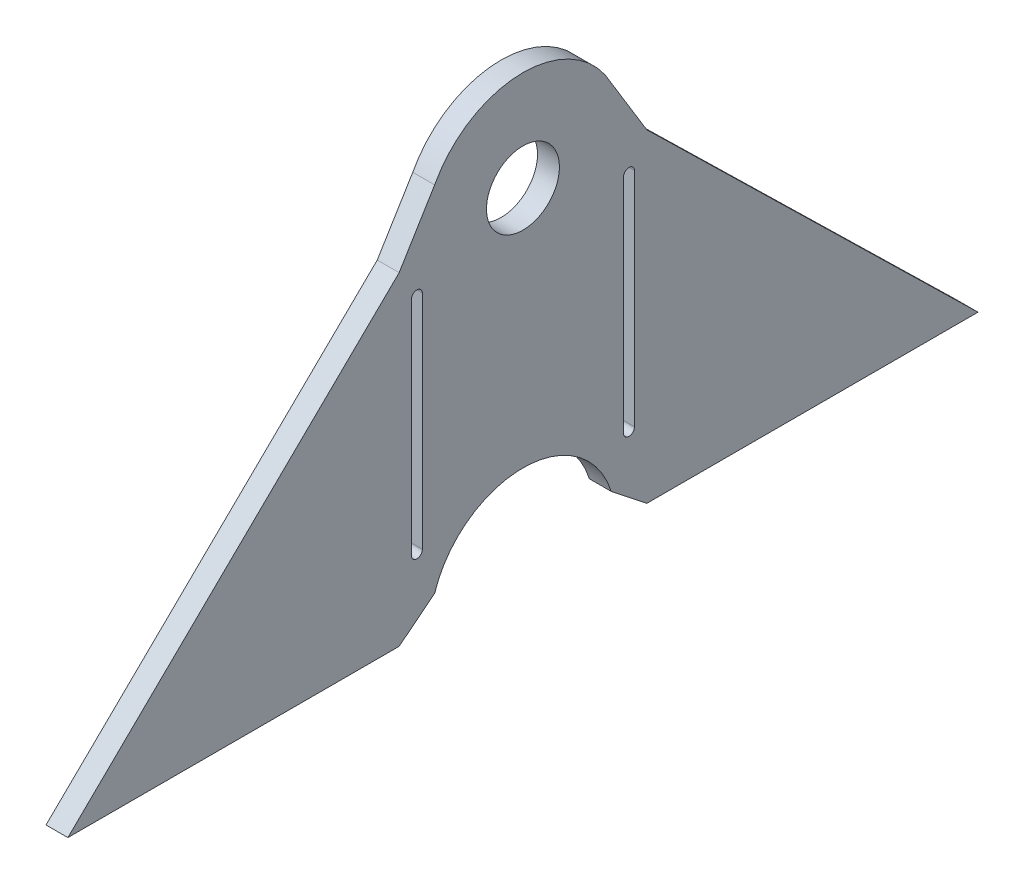
ISO-10303-21;
HEADER;
FILE_DESCRIPTION(('STEP AP214'),'2;1');
FILE_NAME('part.step','',(''),(''),'','','');
FILE_SCHEMA(('AUTOMOTIVE_DESIGN { 1 0 10303 214 1 1 1 1 }'));
ENDSEC;
DATA;
#1=APPLICATION_CONTEXT('core data for automotive mechanical design processes');
#2=APPLICATION_PROTOCOL_DEFINITION('international standard','automotive_design',2000,#1);
#3=PRODUCT_CONTEXT('',#1,'mechanical');
#4=PRODUCT('Part','Part','',(#3));
#5=PRODUCT_RELATED_PRODUCT_CATEGORY('part','',(#4));
#6=PRODUCT_DEFINITION_FORMATION('','',#4);
#7=PRODUCT_DEFINITION_CONTEXT('part definition',#1,'design');
#8=PRODUCT_DEFINITION('design','',#6,#7);
#9=PRODUCT_DEFINITION_SHAPE('','',#8);
#10=(LENGTH_UNIT() NAMED_UNIT(*) SI_UNIT(.MILLI.,.METRE.));
#11=(NAMED_UNIT(*) PLANE_ANGLE_UNIT() SI_UNIT($,.RADIAN.));
#12=(NAMED_UNIT(*) SI_UNIT($,.STERADIAN.) SOLID_ANGLE_UNIT());
#13=UNCERTAINTY_MEASURE_WITH_UNIT(LENGTH_MEASURE(1.E-05),#10,'distance_accuracy_value','');
#14=(GEOMETRIC_REPRESENTATION_CONTEXT(3) GLOBAL_UNCERTAINTY_ASSIGNED_CONTEXT((#13)) GLOBAL_UNIT_ASSIGNED_CONTEXT((#10,
#11,#12)) REPRESENTATION_CONTEXT('',''));
#15=CARTESIAN_POINT('',(0.,0.,0.));
#16=DIRECTION('',(0.,0.,1.));
#17=DIRECTION('',(1.,0.,0.));
#18=AXIS2_PLACEMENT_3D('',#15,#16,#17);
#19=CARTESIAN_POINT('',(3.,0.,0.));
#20=DIRECTION('',(-1.,0.,0.));
#21=DIRECTION('',(0.,0.,1.));
#22=AXIS2_PLACEMENT_3D('',#19,#20,#21);
#23=CYLINDRICAL_SURFACE('',#22,12.7);
#24=DIRECTION('',(1.,0.,0.));
#25=VECTOR('',#24,1.);
#26=CARTESIAN_POINT('',(1.5,3.85746030439719,12.1));
#27=LINE('',#26,#25);
#28=CARTESIAN_POINT('',(0.,3.85746030439718,12.1));
#29=VERTEX_POINT('',#28);
#30=CARTESIAN_POINT('',(3.,3.8574603043972,12.1));
#31=VERTEX_POINT('',#30);
#32=EDGE_CURVE('E306',#29,#31,#27,.T.);
#33=ORIENTED_EDGE('',*,*,#32,.F.);
#34=CARTESIAN_POINT('',(0.,0.,0.));
#35=DIRECTION('',(-1.,0.,0.));
#36=DIRECTION('',(0.,0.,1.));
#37=AXIS2_PLACEMENT_3D('',#34,#35,#36);
#38=CIRCLE('',#37,12.7);
#39=CARTESIAN_POINT('',(0.,3.85746030439718,-12.1));
#40=VERTEX_POINT('',#39);
#41=EDGE_CURVE('E275',#29,#40,#38,.T.);
#42=ORIENTED_EDGE('',*,*,#41,.T.);
#43=DIRECTION('',(-1.,0.,0.));
#44=VECTOR('',#43,1.);
#45=CARTESIAN_POINT('',(3.,3.85746030439718,-12.1));
#46=LINE('',#45,#44);
#47=CARTESIAN_POINT('',(3.,3.85746030439718,-12.1));
#48=VERTEX_POINT('',#47);
#49=EDGE_CURVE('E53',#40,#48,#46,.F.);
#50=ORIENTED_EDGE('',*,*,#49,.T.);
#51=CARTESIAN_POINT('',(3.,0.,0.));
#52=DIRECTION('',(-1.,0.,0.));
#53=DIRECTION('',(0.,0.,-1.));
#54=AXIS2_PLACEMENT_3D('',#51,#52,#53);
#55=CIRCLE('',#54,12.7);
#56=EDGE_CURVE('E270',#31,#48,#55,.T.);
#57=ORIENTED_EDGE('',*,*,#56,.F.);
#58=EDGE_LOOP('',(#33,#42,#50,#57));
#59=FACE_BOUND('',#58,.T.);
#60=ADVANCED_FACE('F44',(#59),#23,.F.);
#61=CARTESIAN_POINT('',(3.,45.9175994254926,0.));
#62=DIRECTION('',(1.,0.,0.));
#63=DIRECTION('',(0.,0.,-1.));
#64=AXIS2_PLACEMENT_3D('',#61,#62,#63);
#65=CYLINDRICAL_SURFACE('',#64,13.7);
#66=DIRECTION('',(1.,0.,0.));
#67=VECTOR('',#66,1.);
#68=CARTESIAN_POINT('',(1.5,52.3425507871762,-12.1));
#69=LINE('',#68,#67);
#70=CARTESIAN_POINT('',(0.,52.3425507871762,-12.1));
#71=VERTEX_POINT('',#70);
#72=CARTESIAN_POINT('',(3.,52.3425507871762,-12.1));
#73=VERTEX_POINT('',#72);
#74=EDGE_CURVE('E12',#71,#73,#69,.T.);
#75=ORIENTED_EDGE('',*,*,#74,.F.);
#76=CARTESIAN_POINT('',(0.,45.9175994254926,0.));
#77=DIRECTION('',(1.,0.,0.));
#78=DIRECTION('',(0.,0.,-1.));
#79=AXIS2_PLACEMENT_3D('',#76,#77,#78);
#80=CIRCLE('',#79,13.7);
#81=CARTESIAN_POINT('',(0.,52.3425507871762,12.1));
#82=VERTEX_POINT('',#81);
#83=EDGE_CURVE('E277',#71,#82,#80,.T.);
#84=ORIENTED_EDGE('',*,*,#83,.T.);
#85=DIRECTION('',(1.,0.,0.));
#86=VECTOR('',#85,1.);
#87=CARTESIAN_POINT('',(3.,52.3425507871762,12.1));
#88=LINE('',#87,#86);
#89=CARTESIAN_POINT('',(3.,52.3425507871762,12.1));
#90=VERTEX_POINT('',#89);
#91=EDGE_CURVE('E269',#82,#90,#88,.T.);
#92=ORIENTED_EDGE('',*,*,#91,.T.);
#93=CARTESIAN_POINT('',(3.,45.9175994254926,0.));
#94=DIRECTION('',(1.,0.,0.));
#95=DIRECTION('',(0.,0.,1.));
#96=AXIS2_PLACEMENT_3D('',#93,#94,#95);
#97=CIRCLE('',#96,13.7);
#98=EDGE_CURVE('E274',#73,#90,#97,.T.);
#99=ORIENTED_EDGE('',*,*,#98,.F.);
#100=EDGE_LOOP('',(#75,#84,#92,#99));
#101=FACE_BOUND('',#100,.T.);
#102=ADVANCED_FACE('F344',(#101),#65,.T.);
#103=CARTESIAN_POINT('',(3.,45.9175994254926,0.));
#104=DIRECTION('',(1.,0.,0.));
#105=DIRECTION('',(0.,0.,-1.));
#106=AXIS2_PLACEMENT_3D('',#103,#104,#105);
#107=CYLINDRICAL_SURFACE('',#106,5.);
#108=CARTESIAN_POINT('',(3.,45.9175994254926,0.));
#109=DIRECTION('',(1.,0.,0.));
#110=DIRECTION('',(0.,0.,-1.));
#111=AXIS2_PLACEMENT_3D('',#108,#109,#110);
#112=CIRCLE('',#111,5.);
#113=CARTESIAN_POINT('',(3.,45.9175994254926,-5.));
#114=VERTEX_POINT('',#113);
#115=EDGE_CURVE('E266',#114,#114,#112,.T.);
#116=ORIENTED_EDGE('',*,*,#115,.T.);
#117=EDGE_LOOP('',(#116));
#118=FACE_BOUND('',#117,.T.);
#119=CARTESIAN_POINT('',(0.,45.9175994254926,0.));
#120=DIRECTION('',(1.,0.,0.));
#121=DIRECTION('',(0.,0.,-1.));
#122=AXIS2_PLACEMENT_3D('',#119,#120,#121);
#123=CIRCLE('',#122,5.);
#124=CARTESIAN_POINT('',(0.,45.9175994254926,-5.));
#125=VERTEX_POINT('',#124);
#126=EDGE_CURVE('E271',#125,#125,#123,.T.);
#127=ORIENTED_EDGE('',*,*,#126,.F.);
#128=EDGE_LOOP('',(#127));
#129=FACE_BOUND('',#128,.T.);
#130=ADVANCED_FACE('F374',(#118,#129),#107,.F.);
#131=CARTESIAN_POINT('',(3.,45.9175994254926,0.));
#132=DIRECTION('',(-1.,0.,0.));
#133=DIRECTION('',(0.,0.,1.));
#134=AXIS2_PLACEMENT_3D('',#131,#132,#133);
#135=PLANE('',#134);
#136=DIRECTION('',(0.,1.,0.));
#137=VECTOR('',#136,1.);
#138=CARTESIAN_POINT('',(3.,40.3484989459004,15.2847343065321));
#139=LINE('',#138,#137);
#140=CARTESIAN_POINT('',(3.,9.92873015219864,15.2847343065321));
#141=VERTEX_POINT('',#140);
#142=CARTESIAN_POINT('',(3.,40.3484989459004,15.2847343065321));
#143=VERTEX_POINT('',#142);
#144=EDGE_CURVE('E179',#141,#143,#139,.T.);
#145=ORIENTED_EDGE('',*,*,#144,.T.);
#146=CARTESIAN_POINT('',(3.,40.3484989459004,14.5347343065321));
#147=DIRECTION('',(-1.,0.,0.));
#148=DIRECTION('',(0.,0.,-1.));
#149=AXIS2_PLACEMENT_3D('',#146,#147,#148);
#150=CIRCLE('',#149,0.749999999999992);
#151=CARTESIAN_POINT('',(3.,40.3484989459004,13.7847343065321));
#152=VERTEX_POINT('',#151);
#153=EDGE_CURVE('E173',#143,#152,#150,.T.);
#154=ORIENTED_EDGE('',*,*,#153,.T.);
#155=DIRECTION('',(0.,-1.,0.));
#156=VECTOR('',#155,1.);
#157=CARTESIAN_POINT('',(3.,40.3484989459004,13.7847343065321));
#158=LINE('',#157,#156);
#159=CARTESIAN_POINT('',(3.,9.92873015219864,13.7847343065321));
#160=VERTEX_POINT('',#159);
#161=EDGE_CURVE('E182',#152,#160,#158,.T.);
#162=ORIENTED_EDGE('',*,*,#161,.T.);
#163=CARTESIAN_POINT('',(3.,9.92873015219864,14.5347343065321));
#164=DIRECTION('',(-1.,0.,0.));
#165=DIRECTION('',(0.,0.,-1.));
#166=AXIS2_PLACEMENT_3D('',#163,#164,#165);
#167=CIRCLE('',#166,0.749999999999992);
#168=EDGE_CURVE('E61',#160,#141,#167,.T.);
#169=ORIENTED_EDGE('',*,*,#168,.T.);
#170=EDGE_LOOP('',(#145,#154,#162,#169));
#171=FACE_BOUND('',#170,.T.);
#172=DIRECTION('',(0.,1.,0.));
#173=VECTOR('',#172,1.);
#174=CARTESIAN_POINT('',(3.,40.3484989459004,-13.7847343065321));
#175=LINE('',#174,#173);
#176=CARTESIAN_POINT('',(3.,9.92873015219863,-13.7847343065321));
#177=VERTEX_POINT('',#176);
#178=CARTESIAN_POINT('',(3.,40.3484989459004,-13.7847343065321));
#179=VERTEX_POINT('',#178);
#180=EDGE_CURVE('E217',#177,#179,#175,.T.);
#181=ORIENTED_EDGE('',*,*,#180,.T.);
#182=CARTESIAN_POINT('',(3.,40.3484989459004,-14.5347343065321));
#183=DIRECTION('',(-1.,0.,0.));
#184=DIRECTION('',(0.,0.,1.));
#185=AXIS2_PLACEMENT_3D('',#182,#183,#184);
#186=CIRCLE('',#185,0.750000000000014);
#187=CARTESIAN_POINT('',(3.,40.3484989459004,-15.2847343065321));
#188=VERTEX_POINT('',#187);
#189=EDGE_CURVE('E207',#179,#188,#186,.T.);
#190=ORIENTED_EDGE('',*,*,#189,.T.);
#191=DIRECTION('',(0.,-1.,0.));
#192=VECTOR('',#191,1.);
#193=CARTESIAN_POINT('',(3.,40.3484989459004,-15.2847343065321));
#194=LINE('',#193,#192);
#195=CARTESIAN_POINT('',(3.,9.92873015219863,-15.2847343065321));
#196=VERTEX_POINT('',#195);
#197=EDGE_CURVE('E210',#188,#196,#194,.T.);
#198=ORIENTED_EDGE('',*,*,#197,.T.);
#199=CARTESIAN_POINT('',(3.,9.92873015219863,-14.5347343065321));
#200=DIRECTION('',(-1.,0.,0.));
#201=DIRECTION('',(0.,0.,1.));
#202=AXIS2_PLACEMENT_3D('',#199,#200,#201);
#203=CIRCLE('',#202,0.750000000000014);
#204=EDGE_CURVE('E214',#196,#177,#203,.T.);
#205=ORIENTED_EDGE('',*,*,#204,.T.);
#206=EDGE_LOOP('',(#181,#190,#198,#205));
#207=FACE_BOUND('',#206,.T.);
#208=ORIENTED_EDGE('',*,*,#98,.T.);
#209=DIRECTION('',(0.,-0.853859185985906,0.520504073478283));
#210=VECTOR('',#209,1.);
#211=CARTESIAN_POINT('',(3.,52.3425507871762,12.1));
#212=LINE('',#211,#210);
#213=CARTESIAN_POINT('',(3.,44.3544471046248,16.9694686130642));
#214=VERTEX_POINT('',#213);
#215=EDGE_CURVE('E284',#90,#214,#212,.T.);
#216=ORIENTED_EDGE('',*,*,#215,.T.);
#217=DIRECTION('',(0.,-0.69882225446553,0.715295363233758));
#218=VECTOR('',#217,1.);
#219=CARTESIAN_POINT('',(3.,0.,62.3694686130642));
#220=LINE('',#219,#218);
#221=CARTESIAN_POINT('',(3.,0.,62.3694686130642));
#222=VERTEX_POINT('',#221);
#223=EDGE_CURVE('E260',#214,#222,#220,.T.);
#224=ORIENTED_EDGE('',*,*,#223,.T.);
#225=DIRECTION('',(0.,0.,-1.));
#226=VECTOR('',#225,1.);
#227=CARTESIAN_POINT('',(3.,0.,12.3694686130642));
#228=LINE('',#227,#226);
#229=CARTESIAN_POINT('',(3.,0.,16.9694686130642));
#230=VERTEX_POINT('',#229);
#231=EDGE_CURVE('E263',#222,#230,#228,.T.);
#232=ORIENTED_EDGE('',*,*,#231,.T.);
#233=DIRECTION('',(0.,0.620946769944342,-0.783852734189075));
#234=VECTOR('',#233,1.);
#235=CARTESIAN_POINT('',(3.,0.,16.9694686130642));
#236=LINE('',#235,#234);
#237=EDGE_CURVE('E279',#230,#31,#236,.T.);
#238=ORIENTED_EDGE('',*,*,#237,.T.);
#239=ORIENTED_EDGE('',*,*,#56,.T.);
#240=DIRECTION('',(0.,-0.620946769944341,-0.783852734189076));
#241=VECTOR('',#240,1.);
#242=CARTESIAN_POINT('',(3.,3.85746030439718,-12.1));
#243=LINE('',#242,#241);
#244=CARTESIAN_POINT('',(3.,0.,-16.9694686130642));
#245=VERTEX_POINT('',#244);
#246=EDGE_CURVE('E296',#48,#245,#243,.T.);
#247=ORIENTED_EDGE('',*,*,#246,.T.);
#248=DIRECTION('',(0.,0.,1.));
#249=VECTOR('',#248,1.);
#250=CARTESIAN_POINT('',(3.,0.,-12.3694686130642));
#251=LINE('',#250,#249);
#252=CARTESIAN_POINT('',(3.,0.,-62.3694686130642));
#253=VERTEX_POINT('',#252);
#254=EDGE_CURVE('E248',#253,#245,#251,.T.);
#255=ORIENTED_EDGE('',*,*,#254,.F.);
#256=DIRECTION('',(0.,-0.69882225446553,-0.715295363233758));
#257=VECTOR('',#256,1.);
#258=CARTESIAN_POINT('',(3.,0.,-62.3694686130642));
#259=LINE('',#258,#257);
#260=CARTESIAN_POINT('',(3.,44.3544471046248,-16.9694686130642));
#261=VERTEX_POINT('',#260);
#262=EDGE_CURVE('E238',#261,#253,#259,.T.);
#263=ORIENTED_EDGE('',*,*,#262,.F.);
#264=DIRECTION('',(0.,0.853859185985906,0.520504073478283));
#265=VECTOR('',#264,1.);
#266=CARTESIAN_POINT('',(3.,44.3544471046248,-16.9694686130642));
#267=LINE('',#266,#265);
#268=EDGE_CURVE('E293',#261,#73,#267,.T.);
#269=ORIENTED_EDGE('',*,*,#268,.T.);
#270=EDGE_LOOP('',(#208,#216,#224,#232,#238,#239,#247,#255,#263,#269));
#271=FACE_BOUND('',#270,.T.);
#272=ORIENTED_EDGE('',*,*,#115,.F.);
#273=EDGE_LOOP('',(#272));
#274=FACE_BOUND('',#273,.T.);
#275=ADVANCED_FACE('F46',(#171,#207,#271,#274),#135,.F.);
#276=CARTESIAN_POINT('',(0.,45.9175994254926,0.));
#277=DIRECTION('',(-1.,0.,0.));
#278=DIRECTION('',(0.,0.,1.));
#279=AXIS2_PLACEMENT_3D('',#276,#277,#278);
#280=PLANE('',#279);
#281=CARTESIAN_POINT('',(0.,40.3484989459004,14.5347343065321));
#282=DIRECTION('',(-1.,0.,0.));
#283=DIRECTION('',(0.,0.,-1.));
#284=AXIS2_PLACEMENT_3D('',#281,#282,#283);
#285=CIRCLE('',#284,0.749999999999992);
#286=CARTESIAN_POINT('',(0.,40.3484989459004,15.2847343065321));
#287=VERTEX_POINT('',#286);
#288=CARTESIAN_POINT('',(0.,40.3484989459004,13.7847343065321));
#289=VERTEX_POINT('',#288);
#290=EDGE_CURVE('E69',#287,#289,#285,.T.);
#291=ORIENTED_EDGE('',*,*,#290,.F.);
#292=DIRECTION('',(0.,1.,0.));
#293=VECTOR('',#292,1.);
#294=CARTESIAN_POINT('',(0.,40.3484989459004,15.2847343065321));
#295=LINE('',#294,#293);
#296=CARTESIAN_POINT('',(0.,9.92873015219864,15.2847343065321));
#297=VERTEX_POINT('',#296);
#298=EDGE_CURVE('E188',#297,#287,#295,.T.);
#299=ORIENTED_EDGE('',*,*,#298,.F.);
#300=CARTESIAN_POINT('',(0.,9.92873015219864,14.5347343065321));
#301=DIRECTION('',(-1.,0.,0.));
#302=DIRECTION('',(0.,0.,-1.));
#303=AXIS2_PLACEMENT_3D('',#300,#301,#302);
#304=CIRCLE('',#303,0.749999999999992);
#305=CARTESIAN_POINT('',(0.,9.92873015219864,13.7847343065321));
#306=VERTEX_POINT('',#305);
#307=EDGE_CURVE('E191',#306,#297,#304,.T.);
#308=ORIENTED_EDGE('',*,*,#307,.F.);
#309=DIRECTION('',(0.,-1.,0.));
#310=VECTOR('',#309,1.);
#311=CARTESIAN_POINT('',(0.,40.3484989459004,13.7847343065321));
#312=LINE('',#311,#310);
#313=EDGE_CURVE('E197',#289,#306,#312,.T.);
#314=ORIENTED_EDGE('',*,*,#313,.F.);
#315=EDGE_LOOP('',(#291,#299,#308,#314));
#316=FACE_BOUND('',#315,.T.);
#317=CARTESIAN_POINT('',(0.,40.3484989459004,-14.5347343065321));
#318=DIRECTION('',(-1.,0.,0.));
#319=DIRECTION('',(0.,0.,1.));
#320=AXIS2_PLACEMENT_3D('',#317,#318,#319);
#321=CIRCLE('',#320,0.750000000000014);
#322=CARTESIAN_POINT('',(0.,40.3484989459004,-13.7847343065321));
#323=VERTEX_POINT('',#322);
#324=CARTESIAN_POINT('',(0.,40.3484989459004,-15.2847343065321));
#325=VERTEX_POINT('',#324);
#326=EDGE_CURVE('E203',#323,#325,#321,.T.);
#327=ORIENTED_EDGE('',*,*,#326,.F.);
#328=DIRECTION('',(0.,1.,0.));
#329=VECTOR('',#328,1.);
#330=CARTESIAN_POINT('',(0.,40.3484989459004,-13.7847343065321));
#331=LINE('',#330,#329);
#332=CARTESIAN_POINT('',(0.,9.92873015219863,-13.7847343065321));
#333=VERTEX_POINT('',#332);
#334=EDGE_CURVE('E211',#333,#323,#331,.T.);
#335=ORIENTED_EDGE('',*,*,#334,.F.);
#336=CARTESIAN_POINT('',(0.,9.92873015219863,-14.5347343065321));
#337=DIRECTION('',(-1.,0.,0.));
#338=DIRECTION('',(0.,0.,1.));
#339=AXIS2_PLACEMENT_3D('',#336,#337,#338);
#340=CIRCLE('',#339,0.750000000000014);
#341=CARTESIAN_POINT('',(0.,9.92873015219863,-15.2847343065321));
#342=VERTEX_POINT('',#341);
#343=EDGE_CURVE('E225',#342,#333,#340,.T.);
#344=ORIENTED_EDGE('',*,*,#343,.F.);
#345=DIRECTION('',(0.,-1.,0.));
#346=VECTOR('',#345,1.);
#347=CARTESIAN_POINT('',(0.,40.3484989459004,-15.2847343065321));
#348=LINE('',#347,#346);
#349=EDGE_CURVE('E222',#325,#342,#348,.T.);
#350=ORIENTED_EDGE('',*,*,#349,.F.);
#351=EDGE_LOOP('',(#327,#335,#344,#350));
#352=FACE_BOUND('',#351,.T.);
#353=ORIENTED_EDGE('',*,*,#83,.F.);
#354=DIRECTION('',(0.,0.853859185985906,0.520504073478283));
#355=VECTOR('',#354,1.);
#356=CARTESIAN_POINT('',(0.,44.3544471046248,-16.9694686130642));
#357=LINE('',#356,#355);
#358=CARTESIAN_POINT('',(0.,44.3544471046248,-16.9694686130642));
#359=VERTEX_POINT('',#358);
#360=EDGE_CURVE('E297',#359,#71,#357,.T.);
#361=ORIENTED_EDGE('',*,*,#360,.F.);
#362=DIRECTION('',(0.,-0.69882225446553,-0.715295363233758));
#363=VECTOR('',#362,1.);
#364=CARTESIAN_POINT('',(0.,0.,-62.3694686130642));
#365=LINE('',#364,#363);
#366=CARTESIAN_POINT('',(0.,0.,-62.3694686130642));
#367=VERTEX_POINT('',#366);
#368=EDGE_CURVE('E245',#359,#367,#365,.T.);
#369=ORIENTED_EDGE('',*,*,#368,.T.);
#370=DIRECTION('',(0.,0.,-1.));
#371=VECTOR('',#370,1.);
#372=CARTESIAN_POINT('',(0.,0.,-12.3694686130642));
#373=LINE('',#372,#371);
#374=CARTESIAN_POINT('',(0.,0.,-16.9694686130642));
#375=VERTEX_POINT('',#374);
#376=EDGE_CURVE('E243',#367,#375,#373,.F.);
#377=ORIENTED_EDGE('',*,*,#376,.T.);
#378=DIRECTION('',(0.,-0.620946769944341,-0.783852734189076));
#379=VECTOR('',#378,1.);
#380=CARTESIAN_POINT('',(0.,3.85746030439718,-12.1));
#381=LINE('',#380,#379);
#382=EDGE_CURVE('E241',#40,#375,#381,.T.);
#383=ORIENTED_EDGE('',*,*,#382,.F.);
#384=ORIENTED_EDGE('',*,*,#41,.F.);
#385=DIRECTION('',(0.,0.620946769944342,-0.783852734189075));
#386=VECTOR('',#385,1.);
#387=CARTESIAN_POINT('',(0.,0.,16.9694686130642));
#388=LINE('',#387,#386);
#389=CARTESIAN_POINT('',(0.,0.,16.9694686130642));
#390=VERTEX_POINT('',#389);
#391=EDGE_CURVE('E285',#390,#29,#388,.T.);
#392=ORIENTED_EDGE('',*,*,#391,.F.);
#393=DIRECTION('',(0.,0.,-1.));
#394=VECTOR('',#393,1.);
#395=CARTESIAN_POINT('',(0.,0.,12.3694686130642));
#396=LINE('',#395,#394);
#397=CARTESIAN_POINT('',(0.,0.,62.3694686130642));
#398=VERTEX_POINT('',#397);
#399=EDGE_CURVE('E252',#398,#390,#396,.T.);
#400=ORIENTED_EDGE('',*,*,#399,.F.);
#401=DIRECTION('',(0.,-0.69882225446553,0.715295363233758));
#402=VECTOR('',#401,1.);
#403=CARTESIAN_POINT('',(0.,0.,62.3694686130642));
#404=LINE('',#403,#402);
#405=CARTESIAN_POINT('',(0.,44.3544471046248,16.9694686130642));
#406=VERTEX_POINT('',#405);
#407=EDGE_CURVE('E257',#406,#398,#404,.T.);
#408=ORIENTED_EDGE('',*,*,#407,.F.);
#409=DIRECTION('',(0.,-0.853859185985906,0.520504073478283));
#410=VECTOR('',#409,1.);
#411=CARTESIAN_POINT('',(0.,52.3425507871762,12.1));
#412=LINE('',#411,#410);
#413=EDGE_CURVE('E288',#82,#406,#412,.T.);
#414=ORIENTED_EDGE('',*,*,#413,.F.);
#415=EDGE_LOOP('',(#353,#361,#369,#377,#383,#384,#392,#400,#408,#414));
#416=FACE_BOUND('',#415,.T.);
#417=ORIENTED_EDGE('',*,*,#126,.T.);
#418=EDGE_LOOP('',(#417));
#419=FACE_BOUND('',#418,.T.);
#420=ADVANCED_FACE('F337',(#316,#352,#416,#419),#280,.T.);
#421=CARTESIAN_POINT('',(1.5,52.3425507871762,12.1));
#422=DIRECTION('',(0.,0.520504073478283,0.853859185985906));
#423=DIRECTION('',(0.,-0.853859185985906,0.520504073478283));
#424=AXIS2_PLACEMENT_3D('',#421,#422,#423);
#425=PLANE('',#424);
#426=ORIENTED_EDGE('',*,*,#91,.F.);
#427=ORIENTED_EDGE('',*,*,#413,.T.);
#428=DIRECTION('',(1.,0.,0.));
#429=VECTOR('',#428,1.);
#430=CARTESIAN_POINT('',(1.5,44.3544471046248,16.9694686130642));
#431=LINE('',#430,#429);
#432=EDGE_CURVE('E265',#406,#214,#431,.T.);
#433=ORIENTED_EDGE('',*,*,#432,.T.);
#434=ORIENTED_EDGE('',*,*,#215,.F.);
#435=EDGE_LOOP('',(#426,#427,#433,#434));
#436=FACE_BOUND('',#435,.T.);
#437=ADVANCED_FACE('F347',(#436),#425,.T.);
#438=CARTESIAN_POINT('',(1.5,0.,16.9694686130642));
#439=DIRECTION('',(0.,-0.783852734189075,-0.620946769944342));
#440=DIRECTION('',(0.,0.620946769944342,-0.783852734189075));
#441=AXIS2_PLACEMENT_3D('',#438,#439,#440);
#442=PLANE('',#441);
#443=ORIENTED_EDGE('',*,*,#391,.T.);
#444=ORIENTED_EDGE('',*,*,#32,.T.);
#445=ORIENTED_EDGE('',*,*,#237,.F.);
#446=DIRECTION('',(1.,0.,0.));
#447=VECTOR('',#446,1.);
#448=CARTESIAN_POINT('',(3.,0.,16.9694686130642));
#449=LINE('',#448,#447);
#450=EDGE_CURVE('E254',#390,#230,#449,.T.);
#451=ORIENTED_EDGE('',*,*,#450,.F.);
#452=EDGE_LOOP('',(#443,#444,#445,#451));
#453=FACE_BOUND('',#452,.T.);
#454=ADVANCED_FACE('F357',(#453),#442,.T.);
#455=CARTESIAN_POINT('',(3.,0.,62.3694686130642));
#456=DIRECTION('',(0.,0.715295363233758,0.69882225446553));
#457=DIRECTION('',(0.,-0.69882225446553,0.715295363233758));
#458=AXIS2_PLACEMENT_3D('',#455,#456,#457);
#459=PLANE('',#458);
#460=ORIENTED_EDGE('',*,*,#432,.F.);
#461=ORIENTED_EDGE('',*,*,#407,.T.);
#462=DIRECTION('',(1.,0.,0.));
#463=VECTOR('',#462,1.);
#464=CARTESIAN_POINT('',(3.,0.,62.3694686130642));
#465=LINE('',#464,#463);
#466=EDGE_CURVE('E255',#398,#222,#465,.T.);
#467=ORIENTED_EDGE('',*,*,#466,.T.);
#468=ORIENTED_EDGE('',*,*,#223,.F.);
#469=EDGE_LOOP('',(#460,#461,#467,#468));
#470=FACE_BOUND('',#469,.T.);
#471=ADVANCED_FACE('F359',(#470),#459,.T.);
#472=CARTESIAN_POINT('',(3.,0.,12.3694686130642));
#473=DIRECTION('',(0.,-1.,0.));
#474=DIRECTION('',(0.,0.,-1.));
#475=AXIS2_PLACEMENT_3D('',#472,#473,#474);
#476=PLANE('',#475);
#477=ORIENTED_EDGE('',*,*,#466,.F.);
#478=ORIENTED_EDGE('',*,*,#399,.T.);
#479=ORIENTED_EDGE('',*,*,#450,.T.);
#480=ORIENTED_EDGE('',*,*,#231,.F.);
#481=EDGE_LOOP('',(#477,#478,#479,#480));
#482=FACE_BOUND('',#481,.T.);
#483=ADVANCED_FACE('F352',(#482),#476,.T.);
#484=CARTESIAN_POINT('',(1.5,3.85746030439718,-12.1));
#485=DIRECTION('',(0.,-0.783852734189076,0.620946769944341));
#486=DIRECTION('',(0.,-0.620946769944341,-0.783852734189076));
#487=AXIS2_PLACEMENT_3D('',#484,#485,#486);
#488=PLANE('',#487);
#489=ORIENTED_EDGE('',*,*,#49,.F.);
#490=ORIENTED_EDGE('',*,*,#382,.T.);
#491=DIRECTION('',(1.,0.,0.));
#492=VECTOR('',#491,1.);
#493=CARTESIAN_POINT('',(1.5,0.,-16.9694686130642));
#494=LINE('',#493,#492);
#495=EDGE_CURVE('E48',#375,#245,#494,.T.);
#496=ORIENTED_EDGE('',*,*,#495,.T.);
#497=ORIENTED_EDGE('',*,*,#246,.F.);
#498=EDGE_LOOP('',(#489,#490,#496,#497));
#499=FACE_BOUND('',#498,.T.);
#500=ADVANCED_FACE('F334',(#499),#488,.T.);
#501=CARTESIAN_POINT('',(1.5,44.3544471046248,-16.9694686130642));
#502=DIRECTION('',(0.,0.520504073478283,-0.853859185985906));
#503=DIRECTION('',(0.,0.853859185985906,0.520504073478283));
#504=AXIS2_PLACEMENT_3D('',#501,#502,#503);
#505=PLANE('',#504);
#506=ORIENTED_EDGE('',*,*,#360,.T.);
#507=ORIENTED_EDGE('',*,*,#74,.T.);
#508=ORIENTED_EDGE('',*,*,#268,.F.);
#509=DIRECTION('',(1.,0.,0.));
#510=VECTOR('',#509,1.);
#511=CARTESIAN_POINT('',(3.,44.3544471046248,-16.9694686130642));
#512=LINE('',#511,#510);
#513=EDGE_CURVE('E242',#359,#261,#512,.T.);
#514=ORIENTED_EDGE('',*,*,#513,.F.);
#515=EDGE_LOOP('',(#506,#507,#508,#514));
#516=FACE_BOUND('',#515,.T.);
#517=ADVANCED_FACE('F321',(#516),#505,.T.);
#518=CARTESIAN_POINT('',(3.,0.,-12.3694686130642));
#519=DIRECTION('',(0.,1.,0.));
#520=DIRECTION('',(0.,0.,1.));
#521=AXIS2_PLACEMENT_3D('',#518,#519,#520);
#522=PLANE('',#521);
#523=ORIENTED_EDGE('',*,*,#495,.F.);
#524=ORIENTED_EDGE('',*,*,#376,.F.);
#525=DIRECTION('',(1.,0.,0.));
#526=VECTOR('',#525,1.);
#527=CARTESIAN_POINT('',(3.,0.,-62.3694686130642));
#528=LINE('',#527,#526);
#529=EDGE_CURVE('E250',#367,#253,#528,.T.);
#530=ORIENTED_EDGE('',*,*,#529,.T.);
#531=ORIENTED_EDGE('',*,*,#254,.T.);
#532=EDGE_LOOP('',(#523,#524,#530,#531));
#533=FACE_BOUND('',#532,.T.);
#534=ADVANCED_FACE('F330',(#533),#522,.F.);
#535=CARTESIAN_POINT('',(3.,0.,-62.3694686130642));
#536=DIRECTION('',(0.,-0.715295363233758,0.69882225446553));
#537=DIRECTION('',(0.,-0.69882225446553,-0.715295363233758));
#538=AXIS2_PLACEMENT_3D('',#535,#536,#537);
#539=PLANE('',#538);
#540=ORIENTED_EDGE('',*,*,#529,.F.);
#541=ORIENTED_EDGE('',*,*,#368,.F.);
#542=ORIENTED_EDGE('',*,*,#513,.T.);
#543=ORIENTED_EDGE('',*,*,#262,.T.);
#544=EDGE_LOOP('',(#540,#541,#542,#543));
#545=FACE_BOUND('',#544,.T.);
#546=ADVANCED_FACE('F318',(#545),#539,.F.);
#547=CARTESIAN_POINT('',(3.,40.3484989459004,-14.5347343065321));
#548=DIRECTION('',(-1.,0.,0.));
#549=DIRECTION('',(0.,0.,1.));
#550=AXIS2_PLACEMENT_3D('',#547,#548,#549);
#551=CYLINDRICAL_SURFACE('',#550,0.750000000000014);
#552=ORIENTED_EDGE('',*,*,#326,.T.);
#553=DIRECTION('',(-1.,0.,0.));
#554=VECTOR('',#553,1.);
#555=CARTESIAN_POINT('',(3.,40.3484989459004,-15.2847343065321));
#556=LINE('',#555,#554);
#557=EDGE_CURVE('E220',#188,#325,#556,.T.);
#558=ORIENTED_EDGE('',*,*,#557,.F.);
#559=ORIENTED_EDGE('',*,*,#189,.F.);
#560=DIRECTION('',(-1.,0.,0.));
#561=VECTOR('',#560,1.);
#562=CARTESIAN_POINT('',(3.,40.3484989459004,-13.7847343065321));
#563=LINE('',#562,#561);
#564=EDGE_CURVE('E230',#179,#323,#563,.T.);
#565=ORIENTED_EDGE('',*,*,#564,.T.);
#566=EDGE_LOOP('',(#552,#558,#559,#565));
#567=FACE_BOUND('',#566,.T.);
#568=ADVANCED_FACE('F398',(#567),#551,.F.);
#569=CARTESIAN_POINT('',(3.,40.3484989459004,-13.7847343065321));
#570=DIRECTION('',(0.,0.,1.));
#571=DIRECTION('',(0.,-1.,0.));
#572=AXIS2_PLACEMENT_3D('',#569,#570,#571);
#573=PLANE('',#572);
#574=ORIENTED_EDGE('',*,*,#334,.T.);
#575=ORIENTED_EDGE('',*,*,#564,.F.);
#576=ORIENTED_EDGE('',*,*,#180,.F.);
#577=DIRECTION('',(-1.,0.,0.));
#578=VECTOR('',#577,1.);
#579=CARTESIAN_POINT('',(3.,9.92873015219863,-13.7847343065321));
#580=LINE('',#579,#578);
#581=EDGE_CURVE('E232',#177,#333,#580,.T.);
#582=ORIENTED_EDGE('',*,*,#581,.T.);
#583=EDGE_LOOP('',(#574,#575,#576,#582));
#584=FACE_BOUND('',#583,.T.);
#585=ADVANCED_FACE('F406',(#584),#573,.F.);
#586=CARTESIAN_POINT('',(3.,9.92873015219863,-14.5347343065321));
#587=DIRECTION('',(-1.,0.,0.));
#588=DIRECTION('',(0.,0.,1.));
#589=AXIS2_PLACEMENT_3D('',#586,#587,#588);
#590=CYLINDRICAL_SURFACE('',#589,0.750000000000014);
#591=ORIENTED_EDGE('',*,*,#343,.T.);
#592=ORIENTED_EDGE('',*,*,#581,.F.);
#593=ORIENTED_EDGE('',*,*,#204,.F.);
#594=DIRECTION('',(-1.,0.,0.));
#595=VECTOR('',#594,1.);
#596=CARTESIAN_POINT('',(3.,9.92873015219863,-15.2847343065321));
#597=LINE('',#596,#595);
#598=EDGE_CURVE('E234',#196,#342,#597,.T.);
#599=ORIENTED_EDGE('',*,*,#598,.T.);
#600=EDGE_LOOP('',(#591,#592,#593,#599));
#601=FACE_BOUND('',#600,.T.);
#602=ADVANCED_FACE('F408',(#601),#590,.F.);
#603=CARTESIAN_POINT('',(3.,40.3484989459004,-15.2847343065321));
#604=DIRECTION('',(0.,0.,-1.));
#605=DIRECTION('',(0.,1.,0.));
#606=AXIS2_PLACEMENT_3D('',#603,#604,#605);
#607=PLANE('',#606);
#608=ORIENTED_EDGE('',*,*,#349,.T.);
#609=ORIENTED_EDGE('',*,*,#598,.F.);
#610=ORIENTED_EDGE('',*,*,#197,.F.);
#611=ORIENTED_EDGE('',*,*,#557,.T.);
#612=EDGE_LOOP('',(#608,#609,#610,#611));
#613=FACE_BOUND('',#612,.T.);
#614=ADVANCED_FACE('F402',(#613),#607,.F.);
#615=CARTESIAN_POINT('',(3.,40.3484989459004,14.5347343065321));
#616=DIRECTION('',(-1.,0.,0.));
#617=DIRECTION('',(0.,0.,1.));
#618=AXIS2_PLACEMENT_3D('',#615,#616,#617);
#619=CYLINDRICAL_SURFACE('',#618,0.749999999999992);
#620=ORIENTED_EDGE('',*,*,#290,.T.);
#621=DIRECTION('',(-1.,0.,0.));
#622=VECTOR('',#621,1.);
#623=CARTESIAN_POINT('',(3.,40.3484989459004,13.7847343065321));
#624=LINE('',#623,#622);
#625=EDGE_CURVE('E169',#152,#289,#624,.T.);
#626=ORIENTED_EDGE('',*,*,#625,.F.);
#627=ORIENTED_EDGE('',*,*,#153,.F.);
#628=DIRECTION('',(-1.,0.,0.));
#629=VECTOR('',#628,1.);
#630=CARTESIAN_POINT('',(3.,40.3484989459004,15.2847343065321));
#631=LINE('',#630,#629);
#632=EDGE_CURVE('E201',#143,#287,#631,.T.);
#633=ORIENTED_EDGE('',*,*,#632,.T.);
#634=EDGE_LOOP('',(#620,#626,#627,#633));
#635=FACE_BOUND('',#634,.T.);
#636=ADVANCED_FACE('F171',(#635),#619,.F.);
#637=CARTESIAN_POINT('',(3.,40.3484989459004,15.2847343065321));
#638=DIRECTION('',(0.,0.,1.));
#639=DIRECTION('',(0.,-1.,0.));
#640=AXIS2_PLACEMENT_3D('',#637,#638,#639);
#641=PLANE('',#640);
#642=ORIENTED_EDGE('',*,*,#298,.T.);
#643=ORIENTED_EDGE('',*,*,#632,.F.);
#644=ORIENTED_EDGE('',*,*,#144,.F.);
#645=DIRECTION('',(-1.,0.,0.));
#646=VECTOR('',#645,1.);
#647=CARTESIAN_POINT('',(3.,9.92873015219864,15.2847343065321));
#648=LINE('',#647,#646);
#649=EDGE_CURVE('E204',#141,#297,#648,.T.);
#650=ORIENTED_EDGE('',*,*,#649,.T.);
#651=EDGE_LOOP('',(#642,#643,#644,#650));
#652=FACE_BOUND('',#651,.T.);
#653=ADVANCED_FACE('F467',(#652),#641,.F.);
#654=CARTESIAN_POINT('',(3.,9.92873015219864,14.5347343065321));
#655=DIRECTION('',(-1.,0.,0.));
#656=DIRECTION('',(0.,0.,1.));
#657=AXIS2_PLACEMENT_3D('',#654,#655,#656);
#658=CYLINDRICAL_SURFACE('',#657,0.749999999999992);
#659=ORIENTED_EDGE('',*,*,#307,.T.);
#660=ORIENTED_EDGE('',*,*,#649,.F.);
#661=ORIENTED_EDGE('',*,*,#168,.F.);
#662=DIRECTION('',(-1.,0.,0.));
#663=VECTOR('',#662,1.);
#664=CARTESIAN_POINT('',(3.,9.92873015219864,13.7847343065321));
#665=LINE('',#664,#663);
#666=EDGE_CURVE('E178',#160,#306,#665,.T.);
#667=ORIENTED_EDGE('',*,*,#666,.T.);
#668=EDGE_LOOP('',(#659,#660,#661,#667));
#669=FACE_BOUND('',#668,.T.);
#670=ADVANCED_FACE('F475',(#669),#658,.F.);
#671=CARTESIAN_POINT('',(3.,40.3484989459004,13.7847343065321));
#672=DIRECTION('',(0.,0.,-1.));
#673=DIRECTION('',(0.,1.,0.));
#674=AXIS2_PLACEMENT_3D('',#671,#672,#673);
#675=PLANE('',#674);
#676=ORIENTED_EDGE('',*,*,#313,.T.);
#677=ORIENTED_EDGE('',*,*,#666,.F.);
#678=ORIENTED_EDGE('',*,*,#161,.F.);
#679=ORIENTED_EDGE('',*,*,#625,.T.);
#680=EDGE_LOOP('',(#676,#677,#678,#679));
#681=FACE_BOUND('',#680,.T.);
#682=ADVANCED_FACE('F183',(#681),#675,.F.);
#683=CLOSED_SHELL('',(#60,#102,#130,#275,#420,#437,#454,#471,#483,#500,#517,#534,#546,#568,#585,
#602,#614,#636,#653,#670,#682));
#684=MANIFOLD_SOLID_BREP('B2',#683);
#685=ADVANCED_BREP_SHAPE_REPRESENTATION('',(#18,#684),#14);
#686=SHAPE_DEFINITION_REPRESENTATION(#9,#685);
ENDSEC;
END-ISO-10303-21;
